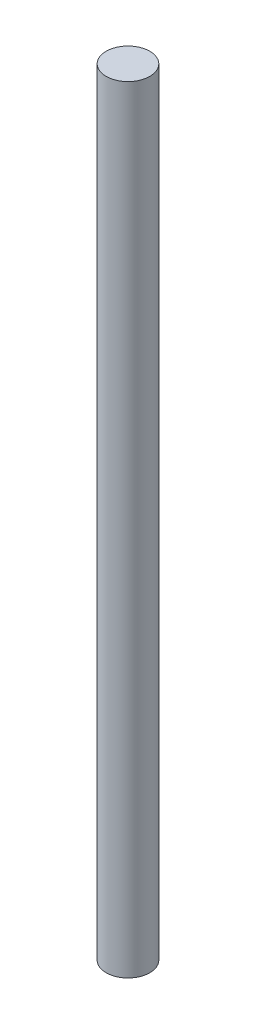
ISO-10303-21;
HEADER;
FILE_DESCRIPTION(('STEP AP214'),'2;1');
FILE_NAME('part.step','',(''),(''),'','','');
FILE_SCHEMA(('AUTOMOTIVE_DESIGN { 1 0 10303 214 1 1 1 1 }'));
ENDSEC;
DATA;
#1=APPLICATION_CONTEXT('core data for automotive mechanical design processes');
#2=APPLICATION_PROTOCOL_DEFINITION('international standard','automotive_design',2000,#1);
#3=PRODUCT_CONTEXT('',#1,'mechanical');
#4=PRODUCT('Part','Part','',(#3));
#5=PRODUCT_RELATED_PRODUCT_CATEGORY('part','',(#4));
#6=PRODUCT_DEFINITION_FORMATION('','',#4);
#7=PRODUCT_DEFINITION_CONTEXT('part definition',#1,'design');
#8=PRODUCT_DEFINITION('design','',#6,#7);
#9=PRODUCT_DEFINITION_SHAPE('','',#8);
#10=(LENGTH_UNIT() NAMED_UNIT(*) SI_UNIT(.MILLI.,.METRE.));
#11=(NAMED_UNIT(*) PLANE_ANGLE_UNIT() SI_UNIT($,.RADIAN.));
#12=(NAMED_UNIT(*) SI_UNIT($,.STERADIAN.) SOLID_ANGLE_UNIT());
#13=UNCERTAINTY_MEASURE_WITH_UNIT(LENGTH_MEASURE(1.E-05),#10,'distance_accuracy_value','');
#14=(GEOMETRIC_REPRESENTATION_CONTEXT(3) GLOBAL_UNCERTAINTY_ASSIGNED_CONTEXT((#13)) GLOBAL_UNIT_ASSIGNED_CONTEXT((#10,
#11,#12)) REPRESENTATION_CONTEXT('',''));
#15=CARTESIAN_POINT('',(0.,0.,0.));
#16=DIRECTION('',(0.,0.,1.));
#17=DIRECTION('',(1.,0.,0.));
#18=AXIS2_PLACEMENT_3D('',#15,#16,#17);
#19=CARTESIAN_POINT('',(0.,113.03,0.));
#20=DIRECTION('',(0.,-1.,0.));
#21=DIRECTION('',(0.,0.,-1.));
#22=AXIS2_PLACEMENT_3D('',#19,#20,#21);
#23=CYLINDRICAL_SURFACE('',#22,3.175);
#24=CARTESIAN_POINT('',(0.,113.03,0.));
#25=DIRECTION('',(0.,1.,0.));
#26=DIRECTION('',(0.,0.,1.));
#27=AXIS2_PLACEMENT_3D('',#24,#25,#26);
#28=CIRCLE('',#27,3.175);
#29=CARTESIAN_POINT('',(0.,113.03,3.175));
#30=VERTEX_POINT('',#29);
#31=EDGE_CURVE('E10',#30,#30,#28,.T.);
#32=ORIENTED_EDGE('',*,*,#31,.F.);
#33=EDGE_LOOP('',(#32));
#34=FACE_BOUND('',#33,.T.);
#35=CARTESIAN_POINT('',(0.,0.,0.));
#36=DIRECTION('',(0.,1.,0.));
#37=DIRECTION('',(0.,0.,1.));
#38=AXIS2_PLACEMENT_3D('',#35,#36,#37);
#39=CIRCLE('',#38,3.175);
#40=CARTESIAN_POINT('',(0.,0.,3.175));
#41=VERTEX_POINT('',#40);
#42=EDGE_CURVE('E45',#41,#41,#39,.T.);
#43=ORIENTED_EDGE('',*,*,#42,.T.);
#44=EDGE_LOOP('',(#43));
#45=FACE_BOUND('',#44,.T.);
#46=ADVANCED_FACE('F42',(#34,#45),#23,.T.);
#47=CARTESIAN_POINT('',(0.,113.03,0.));
#48=DIRECTION('',(0.,1.,0.));
#49=DIRECTION('',(0.,0.,1.));
#50=AXIS2_PLACEMENT_3D('',#47,#48,#49);
#51=PLANE('',#50);
#52=ORIENTED_EDGE('',*,*,#31,.T.);
#53=EDGE_LOOP('',(#52));
#54=FACE_BOUND('',#53,.T.);
#55=ADVANCED_FACE('F59',(#54),#51,.T.);
#56=CARTESIAN_POINT('',(0.,0.,0.));
#57=DIRECTION('',(0.,1.,0.));
#58=DIRECTION('',(0.,0.,1.));
#59=AXIS2_PLACEMENT_3D('',#56,#57,#58);
#60=PLANE('',#59);
#61=ORIENTED_EDGE('',*,*,#42,.F.);
#62=EDGE_LOOP('',(#61));
#63=FACE_BOUND('',#62,.T.);
#64=ADVANCED_FACE('F57',(#63),#60,.F.);
#65=CLOSED_SHELL('',(#46,#55,#64));
#66=MANIFOLD_SOLID_BREP('B2',#65);
#67=ADVANCED_BREP_SHAPE_REPRESENTATION('',(#18,#66),#14);
#68=SHAPE_DEFINITION_REPRESENTATION(#9,#67);
ENDSEC;
END-ISO-10303-21;
